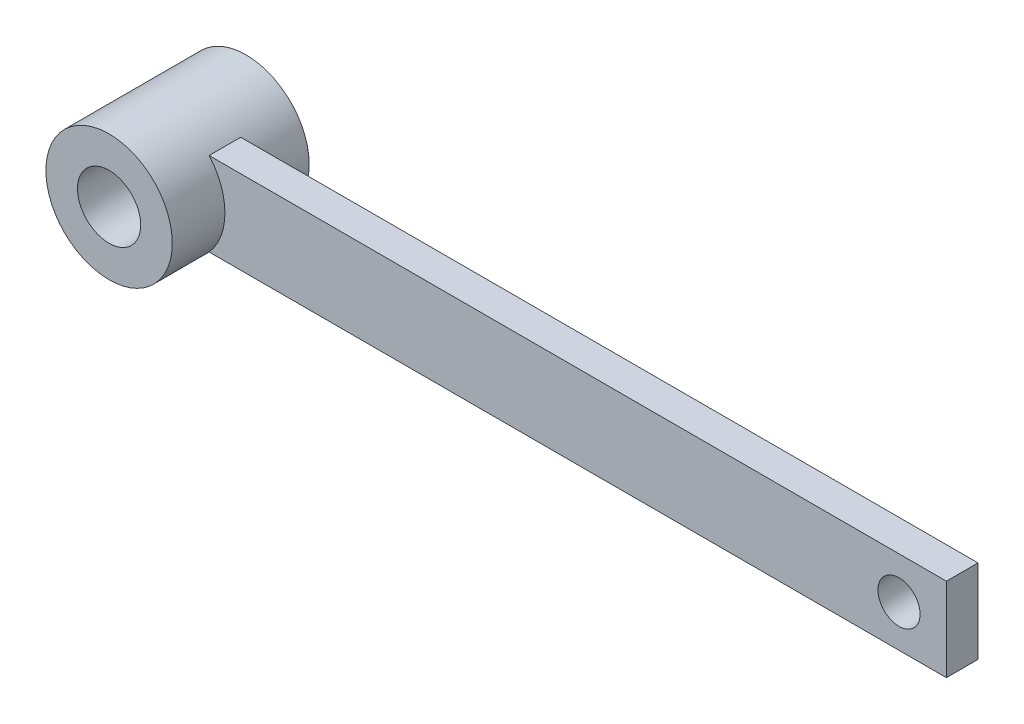
ISO-10303-21;
HEADER;
FILE_DESCRIPTION(('STEP AP214'),'2;1');
FILE_NAME('part.step','',(''),(''),'','','');
FILE_SCHEMA(('AUTOMOTIVE_DESIGN { 1 0 10303 214 1 1 1 1 }'));
ENDSEC;
DATA;
#1=APPLICATION_CONTEXT('core data for automotive mechanical design processes');
#2=APPLICATION_PROTOCOL_DEFINITION('international standard','automotive_design',2000,#1);
#3=PRODUCT_CONTEXT('',#1,'mechanical');
#4=PRODUCT('Part','Part','',(#3));
#5=PRODUCT_RELATED_PRODUCT_CATEGORY('part','',(#4));
#6=PRODUCT_DEFINITION_FORMATION('','',#4);
#7=PRODUCT_DEFINITION_CONTEXT('part definition',#1,'design');
#8=PRODUCT_DEFINITION('design','',#6,#7);
#9=PRODUCT_DEFINITION_SHAPE('','',#8);
#10=(LENGTH_UNIT() NAMED_UNIT(*) SI_UNIT(.MILLI.,.METRE.));
#11=(NAMED_UNIT(*) PLANE_ANGLE_UNIT() SI_UNIT($,.RADIAN.));
#12=(NAMED_UNIT(*) SI_UNIT($,.STERADIAN.) SOLID_ANGLE_UNIT());
#13=UNCERTAINTY_MEASURE_WITH_UNIT(LENGTH_MEASURE(1.E-05),#10,'distance_accuracy_value','');
#14=(GEOMETRIC_REPRESENTATION_CONTEXT(3) GLOBAL_UNCERTAINTY_ASSIGNED_CONTEXT((#13)) GLOBAL_UNIT_ASSIGNED_CONTEXT((#10,
#11,#12)) REPRESENTATION_CONTEXT('',''));
#15=CARTESIAN_POINT('',(0.,0.,0.));
#16=DIRECTION('',(0.,0.,1.));
#17=DIRECTION('',(1.,0.,0.));
#18=AXIS2_PLACEMENT_3D('',#15,#16,#17);
#19=CARTESIAN_POINT('',(0.,3.96862696659689,3.));
#20=DIRECTION('',(0.,1.,0.));
#21=DIRECTION('',(0.,0.,1.));
#22=AXIS2_PLACEMENT_3D('',#19,#20,#21);
#23=PLANE('',#22);
#24=DIRECTION('',(1.,0.,0.));
#25=VECTOR('',#24,1.);
#26=CARTESIAN_POINT('',(0.,3.96862696659689,0.));
#27=LINE('',#26,#25);
#28=CARTESIAN_POINT('',(4.5,3.96862696659689,0.));
#29=VERTEX_POINT('',#28);
#30=CARTESIAN_POINT('',(74.5,3.96862696659689,0.));
#31=VERTEX_POINT('',#30);
#32=EDGE_CURVE('E106',#29,#31,#27,.T.);
#33=ORIENTED_EDGE('',*,*,#32,.F.);
#34=DIRECTION('',(0.,0.,-1.));
#35=VECTOR('',#34,1.);
#36=CARTESIAN_POINT('',(4.5,3.96862696659689,3.));
#37=LINE('',#36,#35);
#38=CARTESIAN_POINT('',(4.5,3.96862696659689,3.));
#39=VERTEX_POINT('',#38);
#40=EDGE_CURVE('E50',#39,#29,#37,.T.);
#41=ORIENTED_EDGE('',*,*,#40,.F.);
#42=DIRECTION('',(1.,0.,0.));
#43=VECTOR('',#42,1.);
#44=CARTESIAN_POINT('',(0.,3.96862696659689,3.));
#45=LINE('',#44,#43);
#46=CARTESIAN_POINT('',(74.5,3.96862696659689,3.));
#47=VERTEX_POINT('',#46);
#48=EDGE_CURVE('E118',#39,#47,#45,.T.);
#49=ORIENTED_EDGE('',*,*,#48,.T.);
#50=DIRECTION('',(0.,0.,-1.));
#51=VECTOR('',#50,1.);
#52=CARTESIAN_POINT('',(74.5,3.96862696659689,3.));
#53=LINE('',#52,#51);
#54=EDGE_CURVE('E58',#47,#31,#53,.T.);
#55=ORIENTED_EDGE('',*,*,#54,.T.);
#56=EDGE_LOOP('',(#33,#41,#49,#55));
#57=FACE_BOUND('',#56,.T.);
#58=ADVANCED_FACE('F41',(#57),#23,.T.);
#59=CARTESIAN_POINT('',(0.,0.,3.));
#60=DIRECTION('',(0.,0.,-1.));
#61=DIRECTION('',(-1.,0.,0.));
#62=AXIS2_PLACEMENT_3D('',#59,#60,#61);
#63=CYLINDRICAL_SURFACE('',#62,6.);
#64=ORIENTED_EDGE('',*,*,#40,.T.);
#65=CARTESIAN_POINT('',(0.,0.,0.));
#66=DIRECTION('',(0.,0.,1.));
#67=DIRECTION('',(1.,0.,0.));
#68=AXIS2_PLACEMENT_3D('',#65,#66,#67);
#69=CIRCLE('',#68,6.);
#70=CARTESIAN_POINT('',(4.5,-3.96862696659689,0.));
#71=VERTEX_POINT('',#70);
#72=EDGE_CURVE('E11',#71,#29,#69,.T.);
#73=ORIENTED_EDGE('',*,*,#72,.F.);
#74=DIRECTION('',(0.,0.,-1.));
#75=VECTOR('',#74,1.);
#76=CARTESIAN_POINT('',(4.5,-3.96862696659689,3.));
#77=LINE('',#76,#75);
#78=CARTESIAN_POINT('',(4.5,-3.96862696659689,3.));
#79=VERTEX_POINT('',#78);
#80=EDGE_CURVE('E90',#79,#71,#77,.T.);
#81=ORIENTED_EDGE('',*,*,#80,.F.);
#82=CARTESIAN_POINT('',(0.,0.,3.));
#83=DIRECTION('',(0.,0.,1.));
#84=DIRECTION('',(1.,0.,0.));
#85=AXIS2_PLACEMENT_3D('',#82,#83,#84);
#86=CIRCLE('',#85,6.);
#87=EDGE_CURVE('E79',#79,#39,#86,.T.);
#88=ORIENTED_EDGE('',*,*,#87,.T.);
#89=EDGE_LOOP('',(#64,#73,#81,#88));
#90=FACE_BOUND('',#89,.T.);
#91=CARTESIAN_POINT('',(0.,0.,-5.));
#92=DIRECTION('',(0.,0.,1.));
#93=DIRECTION('',(1.,0.,0.));
#94=AXIS2_PLACEMENT_3D('',#91,#92,#93);
#95=CIRCLE('',#94,6.);
#96=CARTESIAN_POINT('',(6.,0.,-5.));
#97=VERTEX_POINT('',#96);
#98=EDGE_CURVE('E137',#97,#97,#95,.T.);
#99=ORIENTED_EDGE('',*,*,#98,.T.);
#100=EDGE_LOOP('',(#99));
#101=FACE_BOUND('',#100,.T.);
#102=CARTESIAN_POINT('',(0.,0.,8.));
#103=DIRECTION('',(0.,0.,1.));
#104=DIRECTION('',(1.,0.,0.));
#105=AXIS2_PLACEMENT_3D('',#102,#103,#104);
#106=CIRCLE('',#105,6.);
#107=CARTESIAN_POINT('',(6.,0.,8.));
#108=VERTEX_POINT('',#107);
#109=EDGE_CURVE('E145',#108,#108,#106,.T.);
#110=ORIENTED_EDGE('',*,*,#109,.F.);
#111=EDGE_LOOP('',(#110));
#112=FACE_BOUND('',#111,.T.);
#113=ADVANCED_FACE('F88',(#90,#101,#112),#63,.T.);
#114=CARTESIAN_POINT('',(0.,-3.96862696659689,3.));
#115=DIRECTION('',(0.,1.,0.));
#116=DIRECTION('',(0.,0.,1.));
#117=AXIS2_PLACEMENT_3D('',#114,#115,#116);
#118=PLANE('',#117);
#119=DIRECTION('',(1.,0.,0.));
#120=VECTOR('',#119,1.);
#121=CARTESIAN_POINT('',(0.,-3.96862696659689,0.));
#122=LINE('',#121,#120);
#123=CARTESIAN_POINT('',(74.5,-3.96862696659689,0.));
#124=VERTEX_POINT('',#123);
#125=EDGE_CURVE('E97',#71,#124,#122,.T.);
#126=ORIENTED_EDGE('',*,*,#125,.T.);
#127=DIRECTION('',(0.,0.,-1.));
#128=VECTOR('',#127,1.);
#129=CARTESIAN_POINT('',(74.5,-3.96862696659689,3.));
#130=LINE('',#129,#128);
#131=CARTESIAN_POINT('',(74.5,-3.96862696659689,3.));
#132=VERTEX_POINT('',#131);
#133=EDGE_CURVE('E70',#132,#124,#130,.T.);
#134=ORIENTED_EDGE('',*,*,#133,.F.);
#135=DIRECTION('',(1.,0.,0.));
#136=VECTOR('',#135,1.);
#137=CARTESIAN_POINT('',(0.,-3.96862696659689,3.));
#138=LINE('',#137,#136);
#139=EDGE_CURVE('E99',#79,#132,#138,.T.);
#140=ORIENTED_EDGE('',*,*,#139,.F.);
#141=ORIENTED_EDGE('',*,*,#80,.T.);
#142=EDGE_LOOP('',(#126,#134,#140,#141));
#143=FACE_BOUND('',#142,.T.);
#144=ADVANCED_FACE('F96',(#143),#118,.F.);
#145=CARTESIAN_POINT('',(74.5,0.,3.));
#146=DIRECTION('',(1.,0.,0.));
#147=DIRECTION('',(0.,0.,-1.));
#148=AXIS2_PLACEMENT_3D('',#145,#146,#147);
#149=PLANE('',#148);
#150=DIRECTION('',(0.,-1.,0.));
#151=VECTOR('',#150,1.);
#152=CARTESIAN_POINT('',(74.5,0.,0.));
#153=LINE('',#152,#151);
#154=EDGE_CURVE('E104',#31,#124,#153,.T.);
#155=ORIENTED_EDGE('',*,*,#154,.F.);
#156=ORIENTED_EDGE('',*,*,#54,.F.);
#157=DIRECTION('',(0.,-1.,0.));
#158=VECTOR('',#157,1.);
#159=CARTESIAN_POINT('',(74.5,0.,3.));
#160=LINE('',#159,#158);
#161=EDGE_CURVE('E127',#47,#132,#160,.T.);
#162=ORIENTED_EDGE('',*,*,#161,.T.);
#163=ORIENTED_EDGE('',*,*,#133,.T.);
#164=EDGE_LOOP('',(#155,#156,#162,#163));
#165=FACE_BOUND('',#164,.T.);
#166=ADVANCED_FACE('F171',(#165),#149,.T.);
#167=CARTESIAN_POINT('',(70.,0.,3.));
#168=DIRECTION('',(0.,0.,-1.));
#169=DIRECTION('',(-1.,0.,0.));
#170=AXIS2_PLACEMENT_3D('',#167,#168,#169);
#171=CYLINDRICAL_SURFACE('',#170,2.);
#172=CARTESIAN_POINT('',(70.,0.,3.));
#173=DIRECTION('',(0.,0.,1.));
#174=DIRECTION('',(1.,0.,0.));
#175=AXIS2_PLACEMENT_3D('',#172,#173,#174);
#176=CIRCLE('',#175,2.);
#177=CARTESIAN_POINT('',(72.,0.,3.));
#178=VERTEX_POINT('',#177);
#179=EDGE_CURVE('E121',#178,#178,#176,.T.);
#180=ORIENTED_EDGE('',*,*,#179,.T.);
#181=EDGE_LOOP('',(#180));
#182=FACE_BOUND('',#181,.T.);
#183=CARTESIAN_POINT('',(70.,0.,0.));
#184=DIRECTION('',(0.,0.,1.));
#185=DIRECTION('',(1.,0.,0.));
#186=AXIS2_PLACEMENT_3D('',#183,#184,#185);
#187=CIRCLE('',#186,2.);
#188=CARTESIAN_POINT('',(72.,0.,0.));
#189=VERTEX_POINT('',#188);
#190=EDGE_CURVE('E110',#189,#189,#187,.T.);
#191=ORIENTED_EDGE('',*,*,#190,.F.);
#192=EDGE_LOOP('',(#191));
#193=FACE_BOUND('',#192,.T.);
#194=ADVANCED_FACE('F173',(#182,#193),#171,.F.);
#195=CARTESIAN_POINT('',(0.,0.,3.));
#196=DIRECTION('',(0.,0.,1.));
#197=DIRECTION('',(1.,0.,0.));
#198=AXIS2_PLACEMENT_3D('',#195,#196,#197);
#199=PLANE('',#198);
#200=ORIENTED_EDGE('',*,*,#87,.F.);
#201=ORIENTED_EDGE('',*,*,#139,.T.);
#202=ORIENTED_EDGE('',*,*,#161,.F.);
#203=ORIENTED_EDGE('',*,*,#48,.F.);
#204=EDGE_LOOP('',(#200,#201,#202,#203));
#205=FACE_BOUND('',#204,.T.);
#206=ORIENTED_EDGE('',*,*,#179,.F.);
#207=EDGE_LOOP('',(#206));
#208=FACE_BOUND('',#207,.T.);
#209=ADVANCED_FACE('F179',(#205,#208),#199,.T.);
#210=CARTESIAN_POINT('',(0.,0.,0.));
#211=DIRECTION('',(0.,0.,1.));
#212=DIRECTION('',(1.,0.,0.));
#213=AXIS2_PLACEMENT_3D('',#210,#211,#212);
#214=PLANE('',#213);
#215=ORIENTED_EDGE('',*,*,#125,.F.);
#216=ORIENTED_EDGE('',*,*,#72,.T.);
#217=ORIENTED_EDGE('',*,*,#32,.T.);
#218=ORIENTED_EDGE('',*,*,#154,.T.);
#219=EDGE_LOOP('',(#215,#216,#217,#218));
#220=FACE_BOUND('',#219,.T.);
#221=ORIENTED_EDGE('',*,*,#190,.T.);
#222=EDGE_LOOP('',(#221));
#223=FACE_BOUND('',#222,.T.);
#224=ADVANCED_FACE('F102',(#220,#223),#214,.F.);
#225=CARTESIAN_POINT('',(0.,0.,-5.));
#226=DIRECTION('',(0.,0.,1.));
#227=DIRECTION('',(1.,0.,0.));
#228=AXIS2_PLACEMENT_3D('',#225,#226,#227);
#229=PLANE('',#228);
#230=CARTESIAN_POINT('',(0.,0.,-5.));
#231=DIRECTION('',(0.,0.,1.));
#232=DIRECTION('',(1.,0.,0.));
#233=AXIS2_PLACEMENT_3D('',#230,#231,#232);
#234=CIRCLE('',#233,3.);
#235=CARTESIAN_POINT('',(3.,0.,-5.));
#236=VERTEX_POINT('',#235);
#237=EDGE_CURVE('E141',#236,#236,#234,.T.);
#238=ORIENTED_EDGE('',*,*,#237,.T.);
#239=EDGE_LOOP('',(#238));
#240=FACE_BOUND('',#239,.T.);
#241=ORIENTED_EDGE('',*,*,#98,.F.);
#242=EDGE_LOOP('',(#241));
#243=FACE_BOUND('',#242,.T.);
#244=ADVANCED_FACE('F163',(#240,#243),#229,.F.);
#245=CARTESIAN_POINT('',(0.,0.,3.));
#246=DIRECTION('',(0.,0.,-1.));
#247=DIRECTION('',(-1.,0.,0.));
#248=AXIS2_PLACEMENT_3D('',#245,#246,#247);
#249=CYLINDRICAL_SURFACE('',#248,3.);
#250=ORIENTED_EDGE('',*,*,#237,.F.);
#251=EDGE_LOOP('',(#250));
#252=FACE_BOUND('',#251,.T.);
#253=CARTESIAN_POINT('',(0.,0.,8.));
#254=DIRECTION('',(0.,0.,1.));
#255=DIRECTION('',(1.,0.,0.));
#256=AXIS2_PLACEMENT_3D('',#253,#254,#255);
#257=CIRCLE('',#256,3.);
#258=CARTESIAN_POINT('',(3.,0.,8.));
#259=VERTEX_POINT('',#258);
#260=EDGE_CURVE('E149',#259,#259,#257,.T.);
#261=ORIENTED_EDGE('',*,*,#260,.T.);
#262=EDGE_LOOP('',(#261));
#263=FACE_BOUND('',#262,.T.);
#264=ADVANCED_FACE('F154',(#252,#263),#249,.F.);
#265=CARTESIAN_POINT('',(0.,0.,8.));
#266=DIRECTION('',(0.,0.,1.));
#267=DIRECTION('',(1.,0.,0.));
#268=AXIS2_PLACEMENT_3D('',#265,#266,#267);
#269=PLANE('',#268);
#270=ORIENTED_EDGE('',*,*,#109,.T.);
#271=EDGE_LOOP('',(#270));
#272=FACE_BOUND('',#271,.T.);
#273=ORIENTED_EDGE('',*,*,#260,.F.);
#274=EDGE_LOOP('',(#273));
#275=FACE_BOUND('',#274,.T.);
#276=ADVANCED_FACE('F156',(#272,#275),#269,.T.);
#277=CLOSED_SHELL('',(#58,#113,#144,#166,#194,#209,#224,#244,#264,#276));
#278=MANIFOLD_SOLID_BREP('B2',#277);
#279=ADVANCED_BREP_SHAPE_REPRESENTATION('',(#18,#278),#14);
#280=SHAPE_DEFINITION_REPRESENTATION(#9,#279);
ENDSEC;
END-ISO-10303-21;
